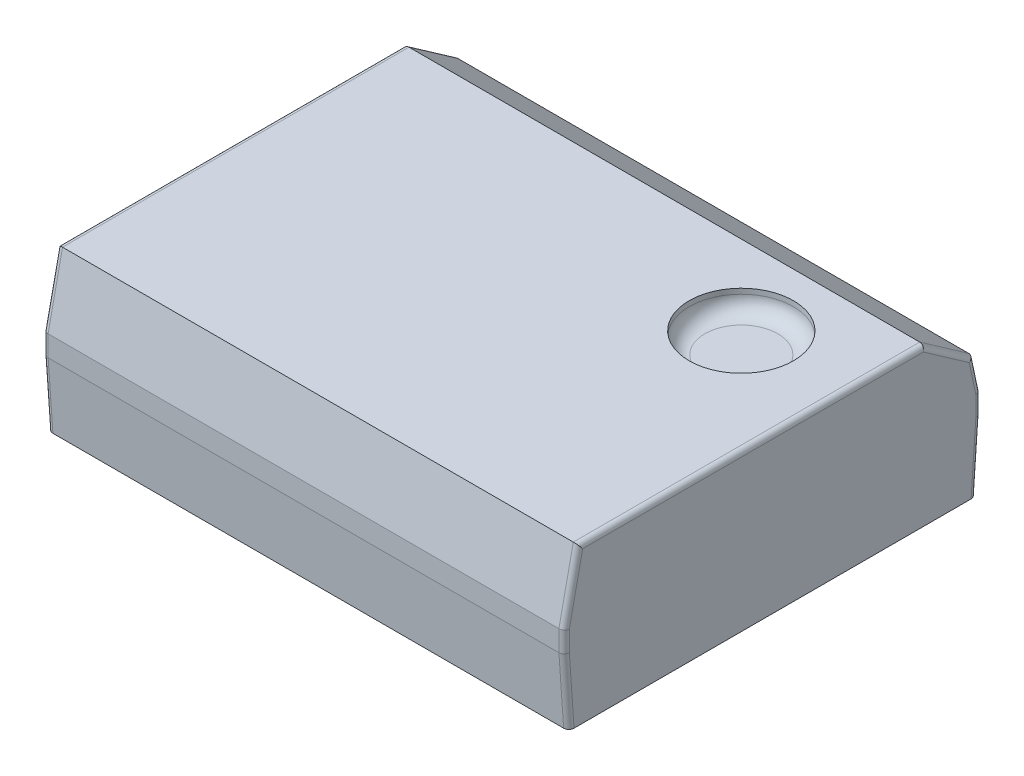
ISO-10303-21;
HEADER;
FILE_DESCRIPTION(('STEP AP214'),'2;1');
FILE_NAME('part.step','',(''),(''),'','','');
FILE_SCHEMA(('AUTOMOTIVE_DESIGN { 1 0 10303 214 1 1 1 1 }'));
ENDSEC;
DATA;
#1=APPLICATION_CONTEXT('core data for automotive mechanical design processes');
#2=APPLICATION_PROTOCOL_DEFINITION('international standard','automotive_design',2000,#1);
#3=PRODUCT_CONTEXT('',#1,'mechanical');
#4=PRODUCT('Part','Part','',(#3));
#5=PRODUCT_RELATED_PRODUCT_CATEGORY('part','',(#4));
#6=PRODUCT_DEFINITION_FORMATION('','',#4);
#7=PRODUCT_DEFINITION_CONTEXT('part definition',#1,'design');
#8=PRODUCT_DEFINITION('design','',#6,#7);
#9=PRODUCT_DEFINITION_SHAPE('','',#8);
#10=(LENGTH_UNIT() NAMED_UNIT(*) SI_UNIT(.MILLI.,.METRE.));
#11=(NAMED_UNIT(*) PLANE_ANGLE_UNIT() SI_UNIT($,.RADIAN.));
#12=(NAMED_UNIT(*) SI_UNIT($,.STERADIAN.) SOLID_ANGLE_UNIT());
#13=UNCERTAINTY_MEASURE_WITH_UNIT(LENGTH_MEASURE(1.E-05),#10,'distance_accuracy_value','');
#14=(GEOMETRIC_REPRESENTATION_CONTEXT(3) GLOBAL_UNCERTAINTY_ASSIGNED_CONTEXT((#13)) GLOBAL_UNIT_ASSIGNED_CONTEXT((#10,
#11,#12)) REPRESENTATION_CONTEXT('',''));
#15=CARTESIAN_POINT('',(0.,0.,0.));
#16=DIRECTION('',(0.,0.,1.));
#17=DIRECTION('',(1.,0.,0.));
#18=AXIS2_PLACEMENT_3D('',#15,#16,#17);
#19=CARTESIAN_POINT('',(1.5,0.55,-0.7));
#20=DIRECTION('',(0.,1.,0.));
#21=DIRECTION('',(0.,0.,1.));
#22=AXIS2_PLACEMENT_3D('',#19,#20,#21);
#23=PLANE('',#22);
#24=CARTESIAN_POINT('',(1.5,0.55,-0.7));
#25=DIRECTION('',(0.,1.,0.));
#26=DIRECTION('',(0.,0.,1.));
#27=AXIS2_PLACEMENT_3D('',#24,#25,#26);
#28=CIRCLE('',#27,0.35);
#29=CARTESIAN_POINT('',(1.5,0.55,-0.35));
#30=VERTEX_POINT('',#29);
#31=EDGE_CURVE('E21',#30,#30,#28,.T.);
#32=ORIENTED_EDGE('',*,*,#31,.T.);
#33=EDGE_LOOP('',(#32));
#34=FACE_BOUND('',#33,.T.);
#35=ADVANCED_FACE('F17',(#34),#23,.T.);
#36=CARTESIAN_POINT('',(1.5,0.7,-0.7));
#37=DIRECTION('',(0.,1.,0.));
#38=DIRECTION('',(0.,0.,1.));
#39=AXIS2_PLACEMENT_3D('',#36,#37,#38);
#40=TOROIDAL_SURFACE('',#39,0.35,0.15);
#41=ORIENTED_EDGE('',*,*,#31,.F.);
#42=EDGE_LOOP('',(#41));
#43=FACE_BOUND('',#42,.T.);
#44=CARTESIAN_POINT('',(1.5,0.7,-0.7));
#45=DIRECTION('',(0.,1.,0.));
#46=DIRECTION('',(0.,0.,1.));
#47=AXIS2_PLACEMENT_3D('',#44,#45,#46);
#48=CIRCLE('',#47,0.5);
#49=CARTESIAN_POINT('',(1.5,0.7,-0.2));
#50=VERTEX_POINT('',#49);
#51=EDGE_CURVE('E194',#50,#50,#48,.T.);
#52=ORIENTED_EDGE('',*,*,#51,.T.);
#53=EDGE_LOOP('',(#52));
#54=FACE_BOUND('',#53,.T.);
#55=ADVANCED_FACE('F19',(#43,#54),#40,.F.);
#56=CARTESIAN_POINT('',(-2.5,0.75,-1.461838234914));
#57=DIRECTION('',(0.,0.819152044289016,-0.573576436351011));
#58=DIRECTION('',(0.,0.573576436351011,0.819152044289016));
#59=AXIS2_PLACEMENT_3D('',#56,#57,#58);
#60=PLANE('',#59);
#61=DIRECTION('',(1.,0.,0.));
#62=VECTOR('',#61,1.);
#63=CARTESIAN_POINT('',(-2.5,0.420942073817915,-1.9317816562936));
#64=LINE('',#63,#62);
#65=CARTESIAN_POINT('',(2.45,0.420942073817686,-1.93178165629399));
#66=VERTEX_POINT('',#65);
#67=CARTESIAN_POINT('',(-2.45,0.420942073817897,-1.93178165629393));
#68=VERTEX_POINT('',#67);
#69=EDGE_CURVE('E188',#66,#68,#64,.F.);
#70=ORIENTED_EDGE('',*,*,#69,.T.);
#71=DIRECTION('',(0.,0.573576436351011,0.819152044289016));
#72=VECTOR('',#71,1.);
#73=CARTESIAN_POINT('',(-2.45,0.75,-1.461838234914));
#74=LINE('',#73,#72);
#75=CARTESIAN_POINT('',(-2.45,0.749999999999773,-1.46183823491432));
#76=VERTEX_POINT('',#75);
#77=EDGE_CURVE('E198',#68,#76,#74,.T.);
#78=ORIENTED_EDGE('',*,*,#77,.T.);
#79=DIRECTION('',(1.,0.,0.));
#80=VECTOR('',#79,1.);
#81=CARTESIAN_POINT('',(-2.5,0.75,-1.461838234914));
#82=LINE('',#81,#80);
#83=CARTESIAN_POINT('',(2.45,0.749999999999773,-1.46183823491432));
#84=VERTEX_POINT('',#83);
#85=EDGE_CURVE('E178',#84,#76,#82,.F.);
#86=ORIENTED_EDGE('',*,*,#85,.F.);
#87=DIRECTION('',(0.,0.573576436351011,0.819152044289016));
#88=VECTOR('',#87,1.);
#89=CARTESIAN_POINT('',(2.45,0.75,-1.461838234914));
#90=LINE('',#89,#88);
#91=EDGE_CURVE('E196',#84,#66,#90,.F.);
#92=ORIENTED_EDGE('',*,*,#91,.T.);
#93=EDGE_LOOP('',(#70,#78,#86,#92));
#94=FACE_BOUND('',#93,.T.);
#95=ADVANCED_FACE('F262',(#94),#60,.T.);
#96=CARTESIAN_POINT('',(1.5,0.55,-0.7));
#97=DIRECTION('',(0.,1.,0.));
#98=DIRECTION('',(0.,0.,1.));
#99=AXIS2_PLACEMENT_3D('',#96,#97,#98);
#100=CYLINDRICAL_SURFACE('',#99,0.5);
#101=CARTESIAN_POINT('',(1.5,0.75,-0.7));
#102=DIRECTION('',(0.,1.,0.));
#103=DIRECTION('',(0.,0.,1.));
#104=AXIS2_PLACEMENT_3D('',#101,#102,#103);
#105=CIRCLE('',#104,0.5);
#106=CARTESIAN_POINT('',(1.5,0.75,-0.2));
#107=VERTEX_POINT('',#106);
#108=EDGE_CURVE('E174',#107,#107,#105,.F.);
#109=ORIENTED_EDGE('',*,*,#108,.F.);
#110=EDGE_LOOP('',(#109));
#111=FACE_BOUND('',#110,.T.);
#112=ORIENTED_EDGE('',*,*,#51,.F.);
#113=EDGE_LOOP('',(#112));
#114=FACE_BOUND('',#113,.T.);
#115=ADVANCED_FACE('F258',(#111,#114),#100,.F.);
#116=CARTESIAN_POINT('',(-2.5,0.75,1.861838234914));
#117=DIRECTION('',(0.,-0.20791169081795,-0.978147600733765));
#118=DIRECTION('',(0.,0.978147600733765,-0.20791169081795));
#119=AXIS2_PLACEMENT_3D('',#116,#117,#118);
#120=PLANE('',#119);
#121=DIRECTION('',(1.,0.,0.));
#122=VECTOR('',#121,1.);
#123=CARTESIAN_POINT('',(-2.5,0.09999999999999,2.));
#124=LINE('',#123,#122);
#125=CARTESIAN_POINT('',(2.45,0.0999999999997729,1.9999999999997));
#126=VERTEX_POINT('',#125);
#127=CARTESIAN_POINT('',(-2.45,0.0999999999997729,1.9999999999997));
#128=VERTEX_POINT('',#127);
#129=EDGE_CURVE('E171',#126,#128,#124,.F.);
#130=ORIENTED_EDGE('',*,*,#129,.F.);
#131=DIRECTION('',(0.,0.978147600733765,-0.20791169081795));
#132=VECTOR('',#131,1.);
#133=CARTESIAN_POINT('',(2.45,0.75,1.861838234914));
#134=LINE('',#133,#132);
#135=CARTESIAN_POINT('',(2.45,0.749999999999695,1.86183823491438));
#136=VERTEX_POINT('',#135);
#137=EDGE_CURVE('E192',#136,#126,#134,.F.);
#138=ORIENTED_EDGE('',*,*,#137,.F.);
#139=DIRECTION('',(1.,0.,0.));
#140=VECTOR('',#139,1.);
#141=CARTESIAN_POINT('',(-2.5,0.75,1.861838234914));
#142=LINE('',#141,#140);
#143=CARTESIAN_POINT('',(-2.45,0.749999999999695,1.86183823491438));
#144=VERTEX_POINT('',#143);
#145=EDGE_CURVE('E175',#144,#136,#142,.T.);
#146=ORIENTED_EDGE('',*,*,#145,.F.);
#147=DIRECTION('',(0.,0.978147600733765,-0.20791169081795));
#148=VECTOR('',#147,1.);
#149=CARTESIAN_POINT('',(-2.45,0.75,1.861838234914));
#150=LINE('',#149,#148);
#151=EDGE_CURVE('E191',#128,#144,#150,.T.);
#152=ORIENTED_EDGE('',*,*,#151,.F.);
#153=EDGE_LOOP('',(#130,#138,#146,#152));
#154=FACE_BOUND('',#153,.T.);
#155=ADVANCED_FACE('F261',(#154),#120,.F.);
#156=CARTESIAN_POINT('',(-2.5,0.75,-1.861838234914));
#157=DIRECTION('',(0.,-0.20791169081795,0.978147600733765));
#158=DIRECTION('',(0.,-0.978147600733765,-0.20791169081795));
#159=AXIS2_PLACEMENT_3D('',#156,#157,#158);
#160=PLANE('',#159);
#161=ORIENTED_EDGE('',*,*,#69,.F.);
#162=DIRECTION('',(0.,-0.978147600733765,-0.20791169081795));
#163=VECTOR('',#162,1.);
#164=CARTESIAN_POINT('',(2.45,-0.713256819498102,-2.17286307330769));
#165=LINE('',#164,#163);
#166=CARTESIAN_POINT('',(2.45,0.100000000000721,-2.));
#167=VERTEX_POINT('',#166);
#168=EDGE_CURVE('E251',#167,#66,#165,.F.);
#169=ORIENTED_EDGE('',*,*,#168,.F.);
#170=DIRECTION('',(-1.,0.,0.));
#171=VECTOR('',#170,1.);
#172=CARTESIAN_POINT('',(-2.5,0.09999999999999,-2.));
#173=LINE('',#172,#171);
#174=CARTESIAN_POINT('',(-2.45,0.0999999999998614,-1.99999999999968));
#175=VERTEX_POINT('',#174);
#176=EDGE_CURVE('E182',#175,#167,#173,.F.);
#177=ORIENTED_EDGE('',*,*,#176,.F.);
#178=DIRECTION('',(0.,-0.978147600733765,-0.20791169081795));
#179=VECTOR('',#178,1.);
#180=CARTESIAN_POINT('',(-2.45,0.75,-1.861838234914));
#181=LINE('',#180,#179);
#182=EDGE_CURVE('E179',#68,#175,#181,.T.);
#183=ORIENTED_EDGE('',*,*,#182,.F.);
#184=EDGE_LOOP('',(#161,#169,#177,#183));
#185=FACE_BOUND('',#184,.T.);
#186=ADVANCED_FACE('F368',(#185),#160,.F.);
#187=CARTESIAN_POINT('',(-2.5,0.75,2.));
#188=DIRECTION('',(0.,1.,0.));
#189=DIRECTION('',(0.,0.,1.));
#190=AXIS2_PLACEMENT_3D('',#187,#188,#189);
#191=PLANE('',#190);
#192=ORIENTED_EDGE('',*,*,#108,.T.);
#193=EDGE_LOOP('',(#192));
#194=FACE_BOUND('',#193,.T.);
#195=ORIENTED_EDGE('',*,*,#85,.T.);
#196=DIRECTION('',(0.,0.,1.));
#197=VECTOR('',#196,1.);
#198=CARTESIAN_POINT('',(-2.45,0.75,2.));
#199=LINE('',#198,#197);
#200=EDGE_CURVE('E240',#144,#76,#199,.F.);
#201=ORIENTED_EDGE('',*,*,#200,.F.);
#202=ORIENTED_EDGE('',*,*,#145,.T.);
#203=DIRECTION('',(0.,0.,-1.));
#204=VECTOR('',#203,1.);
#205=CARTESIAN_POINT('',(2.45,0.75,2.));
#206=LINE('',#205,#204);
#207=EDGE_CURVE('E156',#84,#136,#206,.F.);
#208=ORIENTED_EDGE('',*,*,#207,.F.);
#209=EDGE_LOOP('',(#195,#201,#202,#208));
#210=FACE_BOUND('',#209,.T.);
#211=ADVANCED_FACE('F255',(#194,#210),#191,.T.);
#212=CARTESIAN_POINT('',(-2.5,-0.75,2.));
#213=DIRECTION('',(0.,0.,1.));
#214=DIRECTION('',(1.,0.,0.));
#215=AXIS2_PLACEMENT_3D('',#212,#213,#214);
#216=PLANE('',#215);
#217=ORIENTED_EDGE('',*,*,#129,.T.);
#218=DIRECTION('',(0.,1.,0.));
#219=VECTOR('',#218,1.);
#220=CARTESIAN_POINT('',(-2.45,-0.75,2.));
#221=LINE('',#220,#219);
#222=CARTESIAN_POINT('',(-2.45,-0.0999999999989133,2.));
#223=VERTEX_POINT('',#222);
#224=EDGE_CURVE('E231',#223,#128,#221,.T.);
#225=ORIENTED_EDGE('',*,*,#224,.F.);
#226=DIRECTION('',(1.,0.,0.));
#227=VECTOR('',#226,1.);
#228=CARTESIAN_POINT('',(-2.5,-0.09999999999998,2.));
#229=LINE('',#228,#227);
#230=CARTESIAN_POINT('',(2.45,-0.0999999999989133,2.));
#231=VERTEX_POINT('',#230);
#232=EDGE_CURVE('E228',#231,#223,#229,.F.);
#233=ORIENTED_EDGE('',*,*,#232,.F.);
#234=DIRECTION('',(0.,1.,0.));
#235=VECTOR('',#234,1.);
#236=CARTESIAN_POINT('',(2.45,-0.75,2.));
#237=LINE('',#236,#235);
#238=EDGE_CURVE('E169',#126,#231,#237,.F.);
#239=ORIENTED_EDGE('',*,*,#238,.F.);
#240=EDGE_LOOP('',(#217,#225,#233,#239));
#241=FACE_BOUND('',#240,.T.);
#242=ADVANCED_FACE('F362',(#241),#216,.T.);
#243=CARTESIAN_POINT('',(2.45,0.7,2.));
#244=DIRECTION('',(0.,0.,-1.));
#245=DIRECTION('',(-1.,0.,0.));
#246=AXIS2_PLACEMENT_3D('',#243,#244,#245);
#247=CYLINDRICAL_SURFACE('',#246,0.05);
#248=CARTESIAN_POINT('',(2.45,0.7,1.82134903325488));
#249=DIRECTION('',(0.,0.629320391049762,-0.777145961457032));
#250=DIRECTION('',(0.,0.777145961457032,0.629320391049762));
#251=AXIS2_PLACEMENT_3D('',#248,#249,#250);
#252=ELLIPSE('',#251,0.0643379782946533,0.05);
#253=CARTESIAN_POINT('',(2.5,0.700000000000058,1.82134903325493));
#254=VERTEX_POINT('',#253);
#255=EDGE_CURVE('E153',#254,#136,#252,.F.);
#256=ORIENTED_EDGE('',*,*,#255,.F.);
#257=DIRECTION('',(0.,0.,-1.));
#258=VECTOR('',#257,1.);
#259=CARTESIAN_POINT('',(2.5,0.7,-2.));
#260=LINE('',#259,#258);
#261=CARTESIAN_POINT('',(2.5,0.700000000000045,-1.44607329547094));
#262=VERTEX_POINT('',#261);
#263=EDGE_CURVE('E139',#262,#254,#260,.F.);
#264=ORIENTED_EDGE('',*,*,#263,.F.);
#265=CARTESIAN_POINT('',(2.45,0.7,-1.44607329547084));
#266=DIRECTION('',(0.,0.300705799504253,0.953716950748233));
#267=DIRECTION('',(0.,0.953716950748233,-0.300705799504253));
#268=AXIS2_PLACEMENT_3D('',#265,#266,#267);
#269=ELLIPSE('',#268,0.0524264562570402,0.05);
#270=EDGE_CURVE('E249',#84,#262,#269,.F.);
#271=ORIENTED_EDGE('',*,*,#270,.F.);
#272=ORIENTED_EDGE('',*,*,#207,.T.);
#273=EDGE_LOOP('',(#256,#264,#271,#272));
#274=FACE_BOUND('',#273,.T.);
#275=ADVANCED_FACE('F154',(#274),#247,.T.);
#276=CARTESIAN_POINT('',(2.45,0.08982088211259,1.951046608556));
#277=DIRECTION('',(0.,0.978147600733765,-0.20791169081795));
#278=DIRECTION('',(0.,0.20791169081795,0.978147600733765));
#279=AXIS2_PLACEMENT_3D('',#276,#277,#278);
#280=CYLINDRICAL_SURFACE('',#279,0.05);
#281=CARTESIAN_POINT('',(2.45,0.0947447882379816,1.95));
#282=DIRECTION('',(0.,0.994521895368263,-0.10452846326775));
#283=DIRECTION('',(0.,0.104528463267751,0.994521895368263));
#284=AXIS2_PLACEMENT_3D('',#281,#282,#283);
#285=ELLIPSE('',#284,0.0502754139781763,0.05);
#286=CARTESIAN_POINT('',(2.5,0.094744788237332,1.94999999999987));
#287=VERTEX_POINT('',#286);
#288=EDGE_CURVE('E158',#287,#126,#285,.F.);
#289=ORIENTED_EDGE('',*,*,#288,.F.);
#290=DIRECTION('',(0.,-0.978147600733893,0.207911690817348));
#291=VECTOR('',#290,1.);
#292=CARTESIAN_POINT('',(2.5,0.7,1.821349033255));
#293=LINE('',#292,#291);
#294=EDGE_CURVE('E143',#254,#287,#293,.T.);
#295=ORIENTED_EDGE('',*,*,#294,.F.);
#296=ORIENTED_EDGE('',*,*,#255,.T.);
#297=ORIENTED_EDGE('',*,*,#137,.T.);
#298=EDGE_LOOP('',(#289,#295,#296,#297));
#299=FACE_BOUND('',#298,.T.);
#300=ADVANCED_FACE('F160',(#299),#280,.T.);
#301=CARTESIAN_POINT('',(2.45,-0.75,1.95));
#302=DIRECTION('',(0.,1.,0.));
#303=DIRECTION('',(0.,0.,1.));
#304=AXIS2_PLACEMENT_3D('',#301,#302,#303);
#305=CYLINDRICAL_SURFACE('',#304,0.05);
#306=CARTESIAN_POINT('',(2.45,-0.0982539615232798,1.95));
#307=DIRECTION('',(0.,-0.999390827019096,-0.0348994967024872));
#308=DIRECTION('',(0.,0.0348994967024852,-0.999390827019096));
#309=AXIS2_PLACEMENT_3D('',#306,#307,#308);
#310=ELLIPSE('',#309,0.0500304772149411,0.05);
#311=CARTESIAN_POINT('',(2.5,-0.0982539615243352,1.95));
#312=VERTEX_POINT('',#311);
#313=EDGE_CURVE('E225',#312,#231,#310,.T.);
#314=ORIENTED_EDGE('',*,*,#313,.F.);
#315=DIRECTION('',(0.,1.,0.));
#316=VECTOR('',#315,1.);
#317=CARTESIAN_POINT('',(2.5,-0.75,1.95));
#318=LINE('',#317,#316);
#319=EDGE_CURVE('E163',#287,#312,#318,.F.);
#320=ORIENTED_EDGE('',*,*,#319,.F.);
#321=ORIENTED_EDGE('',*,*,#288,.T.);
#322=ORIENTED_EDGE('',*,*,#238,.T.);
#323=EDGE_LOOP('',(#314,#320,#321,#322));
#324=FACE_BOUND('',#323,.T.);
#325=ADVANCED_FACE('F353',(#324),#305,.T.);
#326=CARTESIAN_POINT('',(2.45,-0.723652404039,-2.123955693271));
#327=DIRECTION('',(0.,-0.978147600733765,-0.20791169081795));
#328=DIRECTION('',(0.,0.20791169081795,-0.978147600733765));
#329=AXIS2_PLACEMENT_3D('',#326,#327,#328);
#330=CYLINDRICAL_SURFACE('',#329,0.05);
#331=CARTESIAN_POINT('',(2.45,0.0947447882381625,-1.95));
#332=DIRECTION('',(0.,0.994521895368263,0.10452846326775));
#333=DIRECTION('',(0.,0.104528463267751,-0.994521895368263));
#334=AXIS2_PLACEMENT_3D('',#331,#332,#333);
#335=ELLIPSE('',#334,0.0502754139781763,0.05);
#336=CARTESIAN_POINT('',(2.5,0.0947447882374181,-1.94999999999985));
#337=VERTEX_POINT('',#336);
#338=EDGE_CURVE('E186',#167,#337,#335,.F.);
#339=ORIENTED_EDGE('',*,*,#338,.F.);
#340=ORIENTED_EDGE('',*,*,#168,.T.);
#341=CARTESIAN_POINT('',(2.45,0.391281359945863,-1.88696920590833));
#342=DIRECTION('',(0.,0.833885822067103,0.551936985312157));
#343=DIRECTION('',(0.,-0.551936985312157,0.833885822067103));
#344=AXIS2_PLACEMENT_3D('',#341,#342,#343);
#345=ELLIPSE('',#344,0.053739312025721,0.05);
#346=CARTESIAN_POINT('',(2.5,0.391281359945843,-1.88696920590803));
#347=VERTEX_POINT('',#346);
#348=EDGE_CURVE('E246',#347,#66,#345,.T.);
#349=ORIENTED_EDGE('',*,*,#348,.F.);
#350=DIRECTION('',(0.,0.978147600733769,0.207911690817933));
#351=VECTOR('',#350,1.);
#352=CARTESIAN_POINT('',(2.5,0.0947447882367,-1.95));
#353=LINE('',#352,#351);
#354=EDGE_CURVE('E391',#337,#347,#353,.T.);
#355=ORIENTED_EDGE('',*,*,#354,.F.);
#356=EDGE_LOOP('',(#339,#340,#349,#355));
#357=FACE_BOUND('',#356,.T.);
#358=ADVANCED_FACE('F349',(#357),#330,.T.);
#359=CARTESIAN_POINT('',(2.45,-0.03729581444019,-2.499040843243));
#360=DIRECTION('',(0.,0.573576436351011,0.819152044289016));
#361=DIRECTION('',(0.,-0.819152044289016,0.573576436351011));
#362=AXIS2_PLACEMENT_3D('',#359,#360,#361);
#363=CYLINDRICAL_SURFACE('',#362,0.05);
#364=ORIENTED_EDGE('',*,*,#348,.T.);
#365=ORIENTED_EDGE('',*,*,#91,.F.);
#366=ORIENTED_EDGE('',*,*,#270,.T.);
#367=DIRECTION('',(0.,0.57357643635127,0.819152044288835));
#368=VECTOR('',#367,1.);
#369=CARTESIAN_POINT('',(2.5,0.391281359946,-1.886969205908));
#370=LINE('',#369,#368);
#371=EDGE_CURVE('E146',#347,#262,#370,.T.);
#372=ORIENTED_EDGE('',*,*,#371,.F.);
#373=EDGE_LOOP('',(#364,#365,#366,#372));
#374=FACE_BOUND('',#373,.T.);
#375=ADVANCED_FACE('F345',(#374),#363,.T.);
#376=CARTESIAN_POINT('',(2.45,-0.75,-1.95));
#377=DIRECTION('',(0.,1.,0.));
#378=DIRECTION('',(0.,0.,1.));
#379=AXIS2_PLACEMENT_3D('',#376,#377,#378);
#380=CYLINDRICAL_SURFACE('',#379,0.05);
#381=CARTESIAN_POINT('',(2.45,-0.0982539615255333,-1.95));
#382=DIRECTION('',(0.,0.999390827019096,-0.0348994967024872));
#383=DIRECTION('',(0.,-0.0348994967024852,-0.999390827019096));
#384=AXIS2_PLACEMENT_3D('',#381,#382,#383);
#385=ELLIPSE('',#384,0.0500304772149411,0.05);
#386=CARTESIAN_POINT('',(2.45,-0.100000000000055,-1.99999999999999));
#387=VERTEX_POINT('',#386);
#388=CARTESIAN_POINT('',(2.5,-0.0982539615254569,-1.94999999999999));
#389=VERTEX_POINT('',#388);
#390=EDGE_CURVE('E222',#387,#389,#385,.F.);
#391=ORIENTED_EDGE('',*,*,#390,.F.);
#392=DIRECTION('',(0.,1.,0.));
#393=VECTOR('',#392,1.);
#394=CARTESIAN_POINT('',(2.45,-0.75,-2.));
#395=LINE('',#394,#393);
#396=EDGE_CURVE('E185',#167,#387,#395,.F.);
#397=ORIENTED_EDGE('',*,*,#396,.F.);
#398=ORIENTED_EDGE('',*,*,#338,.T.);
#399=DIRECTION('',(0.,1.,0.));
#400=VECTOR('',#399,1.);
#401=CARTESIAN_POINT('',(2.5,-0.75,-1.95));
#402=LINE('',#401,#400);
#403=EDGE_CURVE('E393',#389,#337,#402,.T.);
#404=ORIENTED_EDGE('',*,*,#403,.F.);
#405=EDGE_LOOP('',(#391,#397,#398,#404));
#406=FACE_BOUND('',#405,.T.);
#407=ADVANCED_FACE('F341',(#406),#380,.T.);
#408=CARTESIAN_POINT('',(-2.5,-0.75,-2.));
#409=DIRECTION('',(0.,0.,-1.));
#410=DIRECTION('',(-1.,0.,0.));
#411=AXIS2_PLACEMENT_3D('',#408,#409,#410);
#412=PLANE('',#411);
#413=DIRECTION('',(1.,0.,0.));
#414=VECTOR('',#413,1.);
#415=CARTESIAN_POINT('',(-2.5,-0.0999999999999899,-2.));
#416=LINE('',#415,#414);
#417=CARTESIAN_POINT('',(-2.45,-0.100000000000055,-2.));
#418=VERTEX_POINT('',#417);
#419=EDGE_CURVE('E397',#418,#387,#416,.T.);
#420=ORIENTED_EDGE('',*,*,#419,.F.);
#421=DIRECTION('',(0.,1.,0.));
#422=VECTOR('',#421,1.);
#423=CARTESIAN_POINT('',(-2.45,-0.75,-2.));
#424=LINE('',#423,#422);
#425=EDGE_CURVE('E244',#175,#418,#424,.F.);
#426=ORIENTED_EDGE('',*,*,#425,.F.);
#427=ORIENTED_EDGE('',*,*,#176,.T.);
#428=ORIENTED_EDGE('',*,*,#396,.T.);
#429=EDGE_LOOP('',(#420,#426,#427,#428));
#430=FACE_BOUND('',#429,.T.);
#431=ADVANCED_FACE('F337',(#430),#412,.T.);
#432=CARTESIAN_POINT('',(-2.45,-0.75,-1.95));
#433=DIRECTION('',(0.,1.,0.));
#434=DIRECTION('',(0.,0.,1.));
#435=AXIS2_PLACEMENT_3D('',#432,#433,#434);
#436=CYLINDRICAL_SURFACE('',#435,0.05);
#437=CARTESIAN_POINT('',(-2.45,-0.0982539615255333,-1.95));
#438=DIRECTION('',(0.,-0.999390827019096,0.0348994967024872));
#439=DIRECTION('',(0.,0.0348994967024852,0.999390827019096));
#440=AXIS2_PLACEMENT_3D('',#437,#438,#439);
#441=ELLIPSE('',#440,0.0500304772149411,0.05);
#442=CARTESIAN_POINT('',(-2.5,-0.0982539615254503,-1.95));
#443=VERTEX_POINT('',#442);
#444=EDGE_CURVE('E217',#443,#418,#441,.T.);
#445=ORIENTED_EDGE('',*,*,#444,.F.);
#446=DIRECTION('',(0.,1.,0.));
#447=VECTOR('',#446,1.);
#448=CARTESIAN_POINT('',(-2.5,-0.75,-1.95));
#449=LINE('',#448,#447);
#450=CARTESIAN_POINT('',(-2.5,0.0947447882374152,-1.94999999999985));
#451=VERTEX_POINT('',#450);
#452=EDGE_CURVE('E409',#451,#443,#449,.F.);
#453=ORIENTED_EDGE('',*,*,#452,.F.);
#454=CARTESIAN_POINT('',(-2.45,0.0947447882381626,-1.95));
#455=DIRECTION('',(0.,0.994521895368263,0.10452846326775));
#456=DIRECTION('',(0.,-0.104528463267751,0.994521895368263));
#457=AXIS2_PLACEMENT_3D('',#454,#455,#456);
#458=ELLIPSE('',#457,0.0502754139781763,0.05);
#459=EDGE_CURVE('E232',#175,#451,#458,.T.);
#460=ORIENTED_EDGE('',*,*,#459,.F.);
#461=ORIENTED_EDGE('',*,*,#425,.T.);
#462=EDGE_LOOP('',(#445,#453,#460,#461));
#463=FACE_BOUND('',#462,.T.);
#464=ADVANCED_FACE('F333',(#463),#436,.T.);
#465=CARTESIAN_POINT('',(-2.45,0.08982088211259,1.951046608556));
#466=DIRECTION('',(0.,-0.978147600733765,0.20791169081795));
#467=DIRECTION('',(0.,-0.20791169081795,-0.978147600733765));
#468=AXIS2_PLACEMENT_3D('',#465,#466,#467);
#469=CYLINDRICAL_SURFACE('',#468,0.05);
#470=CARTESIAN_POINT('',(-2.45,0.0947447882379816,1.95));
#471=DIRECTION('',(0.,0.994521895368263,-0.10452846326775));
#472=DIRECTION('',(0.,0.104528463267751,0.994521895368263));
#473=AXIS2_PLACEMENT_3D('',#470,#471,#472);
#474=ELLIPSE('',#473,0.0502754139781763,0.05);
#475=CARTESIAN_POINT('',(-2.5,0.0947447882373262,1.94999999999987));
#476=VERTEX_POINT('',#475);
#477=EDGE_CURVE('E229',#128,#476,#474,.F.);
#478=ORIENTED_EDGE('',*,*,#477,.F.);
#479=ORIENTED_EDGE('',*,*,#151,.T.);
#480=CARTESIAN_POINT('',(-2.45,0.7,1.82134903325488));
#481=DIRECTION('',(0.,-0.629320391049762,0.777145961457032));
#482=DIRECTION('',(0.,0.777145961457032,0.629320391049762));
#483=AXIS2_PLACEMENT_3D('',#480,#481,#482);
#484=ELLIPSE('',#483,0.0643379782946533,0.05);
#485=CARTESIAN_POINT('',(-2.5,0.700000000000058,1.82134903325493));
#486=VERTEX_POINT('',#485);
#487=EDGE_CURVE('E241',#486,#144,#484,.F.);
#488=ORIENTED_EDGE('',*,*,#487,.F.);
#489=DIRECTION('',(0.,0.978147600733894,-0.207911690817345));
#490=VECTOR('',#489,1.);
#491=CARTESIAN_POINT('',(-2.5,0.0947447882367,1.95));
#492=LINE('',#491,#490);
#493=EDGE_CURVE('E401',#476,#486,#492,.T.);
#494=ORIENTED_EDGE('',*,*,#493,.F.);
#495=EDGE_LOOP('',(#478,#479,#488,#494));
#496=FACE_BOUND('',#495,.T.);
#497=ADVANCED_FACE('F329',(#496),#469,.T.);
#498=CARTESIAN_POINT('',(-2.45,0.7,2.));
#499=DIRECTION('',(0.,0.,1.));
#500=DIRECTION('',(1.,0.,0.));
#501=AXIS2_PLACEMENT_3D('',#498,#499,#500);
#502=CYLINDRICAL_SURFACE('',#501,0.05);
#503=CARTESIAN_POINT('',(-2.45,0.7,-1.44607329547084));
#504=DIRECTION('',(0.,-0.300705799504253,-0.953716950748233));
#505=DIRECTION('',(0.,-0.953716950748233,0.300705799504253));
#506=AXIS2_PLACEMENT_3D('',#503,#504,#505);
#507=ELLIPSE('',#506,0.0524264562570402,0.05);
#508=CARTESIAN_POINT('',(-2.5,0.700000000000045,-1.44607329547094));
#509=VERTEX_POINT('',#508);
#510=EDGE_CURVE('E237',#509,#76,#507,.T.);
#511=ORIENTED_EDGE('',*,*,#510,.F.);
#512=DIRECTION('',(0.,0.,1.));
#513=VECTOR('',#512,1.);
#514=CARTESIAN_POINT('',(-2.5,0.7,-2.));
#515=LINE('',#514,#513);
#516=EDGE_CURVE('E403',#486,#509,#515,.F.);
#517=ORIENTED_EDGE('',*,*,#516,.F.);
#518=ORIENTED_EDGE('',*,*,#487,.T.);
#519=ORIENTED_EDGE('',*,*,#200,.T.);
#520=EDGE_LOOP('',(#511,#517,#518,#519));
#521=FACE_BOUND('',#520,.T.);
#522=ADVANCED_FACE('F325',(#521),#502,.T.);
#523=CARTESIAN_POINT('',(-2.45,-0.03729581444019,-2.499040843243));
#524=DIRECTION('',(0.,-0.573576436351011,-0.819152044289016));
#525=DIRECTION('',(0.,0.819152044289016,-0.573576436351011));
#526=AXIS2_PLACEMENT_3D('',#523,#524,#525);
#527=CYLINDRICAL_SURFACE('',#526,0.05);
#528=CARTESIAN_POINT('',(-2.45,0.391281359945863,-1.88696920590833));
#529=DIRECTION('',(0.,0.833885822067103,0.551936985312157));
#530=DIRECTION('',(0.,0.551936985312157,-0.833885822067103));
#531=AXIS2_PLACEMENT_3D('',#528,#529,#530);
#532=ELLIPSE('',#531,0.053739312025721,0.05);
#533=CARTESIAN_POINT('',(-2.5,0.391281359945843,-1.88696920590803));
#534=VERTEX_POINT('',#533);
#535=EDGE_CURVE('E234',#534,#68,#532,.F.);
#536=ORIENTED_EDGE('',*,*,#535,.F.);
#537=DIRECTION('',(0.,-0.57357643635127,-0.819152044288835));
#538=VECTOR('',#537,1.);
#539=CARTESIAN_POINT('',(-2.5,0.7,-1.446073295471));
#540=LINE('',#539,#538);
#541=EDGE_CURVE('E408',#509,#534,#540,.T.);
#542=ORIENTED_EDGE('',*,*,#541,.F.);
#543=ORIENTED_EDGE('',*,*,#510,.T.);
#544=ORIENTED_EDGE('',*,*,#77,.F.);
#545=EDGE_LOOP('',(#536,#542,#543,#544));
#546=FACE_BOUND('',#545,.T.);
#547=ADVANCED_FACE('F321',(#546),#527,.T.);
#548=CARTESIAN_POINT('',(-2.45,-0.723652404039,-2.123955693271));
#549=DIRECTION('',(0.,0.978147600733765,0.20791169081795));
#550=DIRECTION('',(0.,-0.20791169081795,0.978147600733765));
#551=AXIS2_PLACEMENT_3D('',#548,#549,#550);
#552=CYLINDRICAL_SURFACE('',#551,0.05);
#553=ORIENTED_EDGE('',*,*,#459,.T.);
#554=DIRECTION('',(0.,-0.978147600733769,-0.207911690817933));
#555=VECTOR('',#554,1.);
#556=CARTESIAN_POINT('',(-2.5,0.391281359946,-1.886969205908));
#557=LINE('',#556,#555);
#558=EDGE_CURVE('E216',#534,#451,#557,.T.);
#559=ORIENTED_EDGE('',*,*,#558,.F.);
#560=ORIENTED_EDGE('',*,*,#535,.T.);
#561=ORIENTED_EDGE('',*,*,#182,.T.);
#562=EDGE_LOOP('',(#553,#559,#560,#561));
#563=FACE_BOUND('',#562,.T.);
#564=ADVANCED_FACE('F317',(#563),#552,.T.);
#565=CARTESIAN_POINT('',(-2.45,-0.75,1.95));
#566=DIRECTION('',(0.,1.,0.));
#567=DIRECTION('',(0.,0.,1.));
#568=AXIS2_PLACEMENT_3D('',#565,#566,#567);
#569=CYLINDRICAL_SURFACE('',#568,0.05);
#570=CARTESIAN_POINT('',(-2.45,-0.0982539615232798,1.95));
#571=DIRECTION('',(0.,0.999390827019096,0.0348994967024872));
#572=DIRECTION('',(0.,-0.0348994967024852,0.999390827019096));
#573=AXIS2_PLACEMENT_3D('',#570,#571,#572);
#574=ELLIPSE('',#573,0.0500304772149411,0.05);
#575=CARTESIAN_POINT('',(-2.5,-0.0982539615243144,1.95000000000007));
#576=VERTEX_POINT('',#575);
#577=EDGE_CURVE('E214',#223,#576,#574,.F.);
#578=ORIENTED_EDGE('',*,*,#577,.F.);
#579=ORIENTED_EDGE('',*,*,#224,.T.);
#580=ORIENTED_EDGE('',*,*,#477,.T.);
#581=DIRECTION('',(0.,1.,0.));
#582=VECTOR('',#581,1.);
#583=CARTESIAN_POINT('',(-2.5,-0.75,1.95));
#584=LINE('',#583,#582);
#585=EDGE_CURVE('E404',#576,#476,#584,.T.);
#586=ORIENTED_EDGE('',*,*,#585,.F.);
#587=EDGE_LOOP('',(#578,#579,#580,#586));
#588=FACE_BOUND('',#587,.T.);
#589=ADVANCED_FACE('F313',(#588),#569,.T.);
#590=CARTESIAN_POINT('',(-2.5,-0.09999999999997,2.));
#591=DIRECTION('',(0.,-0.0697564737440979,0.997564050259826));
#592=DIRECTION('',(0.,-0.997564050259826,-0.0697564737440979));
#593=AXIS2_PLACEMENT_3D('',#590,#591,#592);
#594=PLANE('',#593);
#595=ORIENTED_EDGE('',*,*,#232,.T.);
#596=DIRECTION('',(0.,0.997564050259826,0.0697564737440979));
#597=VECTOR('',#596,1.);
#598=CARTESIAN_POINT('',(-2.45,-1.0251833242612,1.93530487967099));
#599=LINE('',#598,#597);
#600=CARTESIAN_POINT('',(-2.45,-0.749999999999993,1.95454757223669));
#601=VERTEX_POINT('',#600);
#602=EDGE_CURVE('E425',#601,#223,#599,.T.);
#603=ORIENTED_EDGE('',*,*,#602,.F.);
#604=DIRECTION('',(1.,0.,0.));
#605=VECTOR('',#604,1.);
#606=CARTESIAN_POINT('',(-2.5,-0.75,1.954547572237));
#607=LINE('',#606,#605);
#608=CARTESIAN_POINT('',(2.45,-0.749999999999993,1.95454757223669));
#609=VERTEX_POINT('',#608);
#610=EDGE_CURVE('E213',#601,#609,#607,.T.);
#611=ORIENTED_EDGE('',*,*,#610,.T.);
#612=DIRECTION('',(0.,-0.997564050259826,-0.0697564737440979));
#613=VECTOR('',#612,1.);
#614=CARTESIAN_POINT('',(2.45,-1.0251833242612,1.93530487967099));
#615=LINE('',#614,#613);
#616=EDGE_CURVE('E149',#231,#609,#615,.T.);
#617=ORIENTED_EDGE('',*,*,#616,.F.);
#618=EDGE_LOOP('',(#595,#603,#611,#617));
#619=FACE_BOUND('',#618,.T.);
#620=ADVANCED_FACE('F309',(#619),#594,.T.);
#621=CARTESIAN_POINT('',(2.45,-1.021695500574,1.885426677158));
#622=DIRECTION('',(0.,-0.997564050259826,-0.0697564737440979));
#623=DIRECTION('',(0.,0.0697564737440979,-0.997564050259826));
#624=AXIS2_PLACEMENT_3D('',#621,#622,#623);
#625=CYLINDRICAL_SURFACE('',#624,0.05);
#626=CARTESIAN_POINT('',(2.45,-0.75,1.90442547733253));
#627=DIRECTION('',(0.,1.,0.));
#628=DIRECTION('',(0.,0.,-1.));
#629=AXIS2_PLACEMENT_3D('',#626,#627,#628);
#630=ELLIPSE('',#629,0.0501220949040585,0.05);
#631=CARTESIAN_POINT('',(2.5,-0.75,1.90442547733276));
#632=VERTEX_POINT('',#631);
#633=EDGE_CURVE('E210',#609,#632,#630,.T.);
#634=ORIENTED_EDGE('',*,*,#633,.T.);
#635=DIRECTION('',(0.,-0.997564050259861,-0.0697564737436019));
#636=VECTOR('',#635,1.);
#637=CARTESIAN_POINT('',(2.5,-0.09825396152536,1.95));
#638=LINE('',#637,#636);
#639=EDGE_CURVE('E165',#312,#632,#638,.T.);
#640=ORIENTED_EDGE('',*,*,#639,.F.);
#641=ORIENTED_EDGE('',*,*,#313,.T.);
#642=ORIENTED_EDGE('',*,*,#616,.T.);
#643=EDGE_LOOP('',(#634,#640,#641,#642));
#644=FACE_BOUND('',#643,.T.);
#645=ADVANCED_FACE('F306',(#644),#625,.T.);
#646=CARTESIAN_POINT('',(2.5,-0.75,-2.));
#647=DIRECTION('',(1.,0.,0.));
#648=DIRECTION('',(0.,0.,-1.));
#649=AXIS2_PLACEMENT_3D('',#646,#647,#648);
#650=PLANE('',#649);
#651=ORIENTED_EDGE('',*,*,#354,.T.);
#652=ORIENTED_EDGE('',*,*,#371,.T.);
#653=ORIENTED_EDGE('',*,*,#263,.T.);
#654=ORIENTED_EDGE('',*,*,#294,.T.);
#655=ORIENTED_EDGE('',*,*,#319,.T.);
#656=ORIENTED_EDGE('',*,*,#639,.T.);
#657=DIRECTION('',(0.,0.,1.));
#658=VECTOR('',#657,1.);
#659=CARTESIAN_POINT('',(2.5,-0.75,2.));
#660=LINE('',#659,#658);
#661=CARTESIAN_POINT('',(2.5,-0.75,-1.90442547733268));
#662=VERTEX_POINT('',#661);
#663=EDGE_CURVE('E209',#632,#662,#660,.F.);
#664=ORIENTED_EDGE('',*,*,#663,.T.);
#665=DIRECTION('',(0.,0.997564050259826,-0.0697564737440979));
#666=VECTOR('',#665,1.);
#667=CARTESIAN_POINT('',(2.5,-0.743349298653999,-1.90489053967499));
#668=LINE('',#667,#666);
#669=EDGE_CURVE('E224',#389,#662,#668,.F.);
#670=ORIENTED_EDGE('',*,*,#669,.F.);
#671=ORIENTED_EDGE('',*,*,#403,.T.);
#672=EDGE_LOOP('',(#651,#652,#653,#654,#655,#656,#664,#670,#671));
#673=FACE_BOUND('',#672,.T.);
#674=ADVANCED_FACE('F141',(#673),#650,.T.);
#675=CARTESIAN_POINT('',(2.45,-0.743349298654,-1.904890539675));
#676=DIRECTION('',(0.,0.997564050259826,-0.0697564737440979));
#677=DIRECTION('',(0.,0.0697564737440979,0.997564050259826));
#678=AXIS2_PLACEMENT_3D('',#675,#676,#677);
#679=CYLINDRICAL_SURFACE('',#678,0.05);
#680=CARTESIAN_POINT('',(2.45,-0.75,-1.90442547733269));
#681=DIRECTION('',(0.,1.,0.));
#682=DIRECTION('',(0.,0.,-1.));
#683=AXIS2_PLACEMENT_3D('',#680,#681,#682);
#684=ELLIPSE('',#683,0.0501220949040585,0.05);
#685=CARTESIAN_POINT('',(2.45,-0.749999999999995,-1.9545475722368));
#686=VERTEX_POINT('',#685);
#687=EDGE_CURVE('E206',#662,#686,#684,.T.);
#688=ORIENTED_EDGE('',*,*,#687,.T.);
#689=DIRECTION('',(0.,0.997564050259826,-0.0697564737440979));
#690=VECTOR('',#689,1.);
#691=CARTESIAN_POINT('',(2.45,-0.09999999999997,-2.));
#692=LINE('',#691,#690);
#693=EDGE_CURVE('E221',#387,#686,#692,.F.);
#694=ORIENTED_EDGE('',*,*,#693,.F.);
#695=ORIENTED_EDGE('',*,*,#390,.T.);
#696=ORIENTED_EDGE('',*,*,#669,.T.);
#697=EDGE_LOOP('',(#688,#694,#695,#696));
#698=FACE_BOUND('',#697,.T.);
#699=ADVANCED_FACE('F299',(#698),#679,.T.);
#700=CARTESIAN_POINT('',(-2.5,-0.09999999999997,-2.));
#701=DIRECTION('',(0.,-0.0697564737440979,-0.997564050259826));
#702=DIRECTION('',(0.,0.997564050259826,-0.0697564737440979));
#703=AXIS2_PLACEMENT_3D('',#700,#701,#702);
#704=PLANE('',#703);
#705=DIRECTION('',(1.,0.,0.));
#706=VECTOR('',#705,1.);
#707=CARTESIAN_POINT('',(-2.5,-0.75,-1.954547572237));
#708=LINE('',#707,#706);
#709=CARTESIAN_POINT('',(-2.45,-0.749999999999996,-1.95454757223681));
#710=VERTEX_POINT('',#709);
#711=EDGE_CURVE('E205',#686,#710,#708,.F.);
#712=ORIENTED_EDGE('',*,*,#711,.T.);
#713=DIRECTION('',(0.,-0.997564050259826,0.0697564737440979));
#714=VECTOR('',#713,1.);
#715=CARTESIAN_POINT('',(-2.45,-0.746837122341205,-1.95476874218799));
#716=LINE('',#715,#714);
#717=EDGE_CURVE('E220',#418,#710,#716,.T.);
#718=ORIENTED_EDGE('',*,*,#717,.F.);
#719=ORIENTED_EDGE('',*,*,#419,.T.);
#720=ORIENTED_EDGE('',*,*,#693,.T.);
#721=EDGE_LOOP('',(#712,#718,#719,#720));
#722=FACE_BOUND('',#721,.T.);
#723=ADVANCED_FACE('F295',(#722),#704,.T.);
#724=CARTESIAN_POINT('',(-2.45,-0.743349298654,-1.904890539675));
#725=DIRECTION('',(0.,-0.997564050259826,0.0697564737440979));
#726=DIRECTION('',(0.,-0.0697564737440979,-0.997564050259826));
#727=AXIS2_PLACEMENT_3D('',#724,#725,#726);
#728=CYLINDRICAL_SURFACE('',#727,0.05);
#729=CARTESIAN_POINT('',(-2.45,-0.75,-1.90442547733269));
#730=DIRECTION('',(0.,1.,0.));
#731=DIRECTION('',(0.,0.,1.));
#732=AXIS2_PLACEMENT_3D('',#729,#730,#731);
#733=ELLIPSE('',#732,0.0501220949040585,0.05);
#734=CARTESIAN_POINT('',(-2.5,-0.75,-1.90442547733284));
#735=VERTEX_POINT('',#734);
#736=EDGE_CURVE('E202',#710,#735,#733,.T.);
#737=ORIENTED_EDGE('',*,*,#736,.T.);
#738=DIRECTION('',(0.,-0.997564050259861,0.0697564737436031));
#739=VECTOR('',#738,1.);
#740=CARTESIAN_POINT('',(-2.5,-0.09825396152538,-1.95));
#741=LINE('',#740,#739);
#742=EDGE_CURVE('E411',#443,#735,#741,.T.);
#743=ORIENTED_EDGE('',*,*,#742,.F.);
#744=ORIENTED_EDGE('',*,*,#444,.T.);
#745=ORIENTED_EDGE('',*,*,#717,.T.);
#746=EDGE_LOOP('',(#737,#743,#744,#745));
#747=FACE_BOUND('',#746,.T.);
#748=ADVANCED_FACE('F291',(#747),#728,.T.);
#749=CARTESIAN_POINT('',(-2.5,-0.75,-2.));
#750=DIRECTION('',(-1.,0.,0.));
#751=DIRECTION('',(0.,0.,1.));
#752=AXIS2_PLACEMENT_3D('',#749,#750,#751);
#753=PLANE('',#752);
#754=ORIENTED_EDGE('',*,*,#541,.T.);
#755=ORIENTED_EDGE('',*,*,#558,.T.);
#756=ORIENTED_EDGE('',*,*,#452,.T.);
#757=ORIENTED_EDGE('',*,*,#742,.T.);
#758=DIRECTION('',(0.,0.,1.));
#759=VECTOR('',#758,1.);
#760=CARTESIAN_POINT('',(-2.5,-0.75,2.));
#761=LINE('',#760,#759);
#762=CARTESIAN_POINT('',(-2.5,-0.75,1.9044254773326));
#763=VERTEX_POINT('',#762);
#764=EDGE_CURVE('E27',#735,#763,#761,.T.);
#765=ORIENTED_EDGE('',*,*,#764,.T.);
#766=DIRECTION('',(0.,0.997564050259826,0.0697564737440979));
#767=VECTOR('',#766,1.);
#768=CARTESIAN_POINT('',(-2.5,-1.02169550057401,1.88542667715814));
#769=LINE('',#768,#767);
#770=EDGE_CURVE('E35',#576,#763,#769,.F.);
#771=ORIENTED_EDGE('',*,*,#770,.F.);
#772=ORIENTED_EDGE('',*,*,#585,.T.);
#773=ORIENTED_EDGE('',*,*,#493,.T.);
#774=ORIENTED_EDGE('',*,*,#516,.T.);
#775=EDGE_LOOP('',(#754,#755,#756,#757,#765,#771,#772,#773,#774));
#776=FACE_BOUND('',#775,.T.);
#777=ADVANCED_FACE('F285',(#776),#753,.T.);
#778=CARTESIAN_POINT('',(-2.45,-1.021695500574,1.885426677158));
#779=DIRECTION('',(0.,0.997564050259826,0.0697564737440979));
#780=DIRECTION('',(0.,-0.0697564737440979,0.997564050259826));
#781=AXIS2_PLACEMENT_3D('',#778,#779,#780);
#782=CYLINDRICAL_SURFACE('',#781,0.05);
#783=CARTESIAN_POINT('',(-2.45,-0.75,1.90442547733253));
#784=DIRECTION('',(0.,1.,0.));
#785=DIRECTION('',(0.,0.,1.));
#786=AXIS2_PLACEMENT_3D('',#783,#784,#785);
#787=ELLIPSE('',#786,0.0501220949040585,0.05);
#788=EDGE_CURVE('E11',#763,#601,#787,.T.);
#789=ORIENTED_EDGE('',*,*,#788,.T.);
#790=ORIENTED_EDGE('',*,*,#602,.T.);
#791=ORIENTED_EDGE('',*,*,#577,.T.);
#792=ORIENTED_EDGE('',*,*,#770,.T.);
#793=EDGE_LOOP('',(#789,#790,#791,#792));
#794=FACE_BOUND('',#793,.T.);
#795=ADVANCED_FACE('F279',(#794),#782,.T.);
#796=CARTESIAN_POINT('',(-2.5,-0.75,2.));
#797=DIRECTION('',(0.,1.,0.));
#798=DIRECTION('',(0.,0.,1.));
#799=AXIS2_PLACEMENT_3D('',#796,#797,#798);
#800=PLANE('',#799);
#801=ORIENTED_EDGE('',*,*,#764,.F.);
#802=ORIENTED_EDGE('',*,*,#736,.F.);
#803=ORIENTED_EDGE('',*,*,#711,.F.);
#804=ORIENTED_EDGE('',*,*,#687,.F.);
#805=ORIENTED_EDGE('',*,*,#663,.F.);
#806=ORIENTED_EDGE('',*,*,#633,.F.);
#807=ORIENTED_EDGE('',*,*,#610,.F.);
#808=ORIENTED_EDGE('',*,*,#788,.F.);
#809=EDGE_LOOP('',(#801,#802,#803,#804,#805,#806,#807,#808));
#810=FACE_BOUND('',#809,.T.);
#811=ADVANCED_FACE('F277',(#810),#800,.F.);
#812=CLOSED_SHELL('',(#35,#55,#95,#115,#155,#186,#211,#242,#275,#300,#325,#358,#375,#407,#431,
#464,#497,#522,#547,#564,#589,#620,#645,#674,#699,#723,#748,#777,#795,#811));
#813=MANIFOLD_SOLID_BREP('B1',#812);
#814=ADVANCED_BREP_SHAPE_REPRESENTATION('',(#18,#813),#14);
#815=SHAPE_DEFINITION_REPRESENTATION(#9,#814);
ENDSEC;
END-ISO-10303-21;
